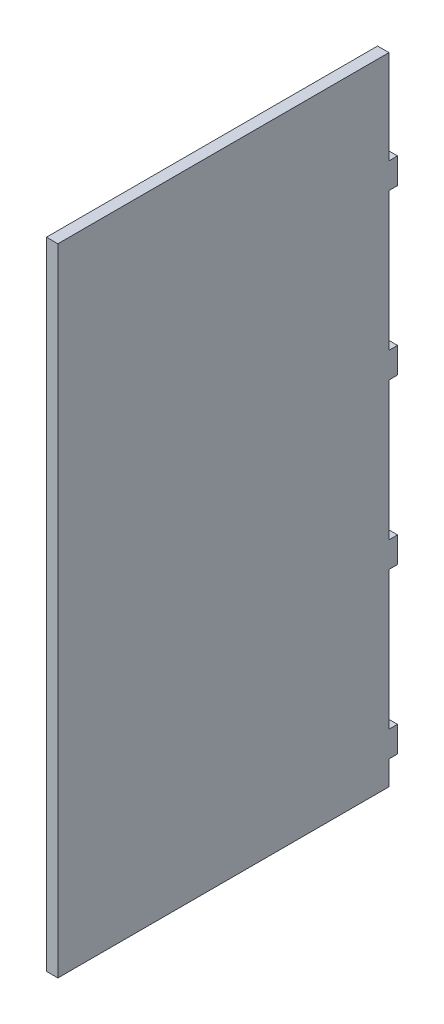
ISO-10303-21;
HEADER;
FILE_DESCRIPTION(('STEP AP214'),'2;1');
FILE_NAME('part.step','',(''),(''),'','','');
FILE_SCHEMA(('AUTOMOTIVE_DESIGN { 1 0 10303 214 1 1 1 1 }'));
ENDSEC;
DATA;
#1=APPLICATION_CONTEXT('core data for automotive mechanical design processes');
#2=APPLICATION_PROTOCOL_DEFINITION('international standard','automotive_design',2000,#1);
#3=PRODUCT_CONTEXT('',#1,'mechanical');
#4=PRODUCT('Part','Part','',(#3));
#5=PRODUCT_RELATED_PRODUCT_CATEGORY('part','',(#4));
#6=PRODUCT_DEFINITION_FORMATION('','',#4);
#7=PRODUCT_DEFINITION_CONTEXT('part definition',#1,'design');
#8=PRODUCT_DEFINITION('design','',#6,#7);
#9=PRODUCT_DEFINITION_SHAPE('','',#8);
#10=(LENGTH_UNIT() NAMED_UNIT(*) SI_UNIT(.MILLI.,.METRE.));
#11=(NAMED_UNIT(*) PLANE_ANGLE_UNIT() SI_UNIT($,.RADIAN.));
#12=(NAMED_UNIT(*) SI_UNIT($,.STERADIAN.) SOLID_ANGLE_UNIT());
#13=UNCERTAINTY_MEASURE_WITH_UNIT(LENGTH_MEASURE(1.E-05),#10,'distance_accuracy_value','');
#14=(GEOMETRIC_REPRESENTATION_CONTEXT(3) GLOBAL_UNCERTAINTY_ASSIGNED_CONTEXT((#13)) GLOBAL_UNIT_ASSIGNED_CONTEXT((#10,
#11,#12)) REPRESENTATION_CONTEXT('',''));
#15=CARTESIAN_POINT('',(0.,0.,0.));
#16=DIRECTION('',(0.,0.,1.));
#17=DIRECTION('',(1.,0.,0.));
#18=AXIS2_PLACEMENT_3D('',#15,#16,#17);
#19=CARTESIAN_POINT('',(215.,50.497083943488,0.));
#20=DIRECTION('',(0.,0.,1.));
#21=DIRECTION('',(0.,1.,0.));
#22=AXIS2_PLACEMENT_3D('',#19,#20,#21);
#23=PLANE('',#22);
#24=DIRECTION('',(1.,0.,0.));
#25=VECTOR('',#24,1.);
#26=CARTESIAN_POINT('',(215.,50.497083943488,0.));
#27=LINE('',#26,#25);
#28=CARTESIAN_POINT('',(211.,50.497083943488,0.));
#29=VERTEX_POINT('',#28);
#30=CARTESIAN_POINT('',(215.,50.497083943488,0.));
#31=VERTEX_POINT('',#30);
#32=EDGE_CURVE('E11',#29,#31,#27,.T.);
#33=ORIENTED_EDGE('',*,*,#32,.F.);
#34=DIRECTION('',(0.,1.,0.));
#35=VECTOR('',#34,1.);
#36=CARTESIAN_POINT('',(211.,0.,0.));
#37=LINE('',#36,#35);
#38=CARTESIAN_POINT('',(211.,83.3431457505073,0.));
#39=VERTEX_POINT('',#38);
#40=EDGE_CURVE('E140',#29,#39,#37,.T.);
#41=ORIENTED_EDGE('',*,*,#40,.T.);
#42=DIRECTION('',(1.,0.,0.));
#43=VECTOR('',#42,1.);
#44=CARTESIAN_POINT('',(215.,83.3431457505073,0.));
#45=LINE('',#44,#43);
#46=CARTESIAN_POINT('',(215.,83.3431457505073,0.));
#47=VERTEX_POINT('',#46);
#48=EDGE_CURVE('E47',#39,#47,#45,.T.);
#49=ORIENTED_EDGE('',*,*,#48,.T.);
#50=DIRECTION('',(0.,1.,0.));
#51=VECTOR('',#50,1.);
#52=CARTESIAN_POINT('',(215.,50.497083943488,0.));
#53=LINE('',#52,#51);
#54=EDGE_CURVE('E251',#31,#47,#53,.T.);
#55=ORIENTED_EDGE('',*,*,#54,.F.);
#56=EDGE_LOOP('',(#33,#41,#49,#55));
#57=FACE_BOUND('',#56,.T.);
#58=ADVANCED_FACE('F37',(#57),#23,.F.);
#59=CARTESIAN_POINT('',(215.,83.3431457505073,0.));
#60=DIRECTION('',(0.,-1.,0.));
#61=DIRECTION('',(0.,0.,1.));
#62=AXIS2_PLACEMENT_3D('',#59,#60,#61);
#63=PLANE('',#62);
#64=ORIENTED_EDGE('',*,*,#48,.F.);
#65=DIRECTION('',(0.,0.,1.));
#66=VECTOR('',#65,1.);
#67=CARTESIAN_POINT('',(211.,83.3431457505073,0.));
#68=LINE('',#67,#66);
#69=CARTESIAN_POINT('',(211.,83.3431457505073,116.));
#70=VERTEX_POINT('',#69);
#71=EDGE_CURVE('E195',#39,#70,#68,.T.);
#72=ORIENTED_EDGE('',*,*,#71,.T.);
#73=DIRECTION('',(1.,0.,0.));
#74=VECTOR('',#73,1.);
#75=CARTESIAN_POINT('',(215.,83.3431457505073,116.));
#76=LINE('',#75,#74);
#77=CARTESIAN_POINT('',(215.,83.3431457505073,116.));
#78=VERTEX_POINT('',#77);
#79=EDGE_CURVE('E244',#70,#78,#76,.T.);
#80=ORIENTED_EDGE('',*,*,#79,.T.);
#81=DIRECTION('',(0.,0.,1.));
#82=VECTOR('',#81,1.);
#83=CARTESIAN_POINT('',(215.,83.3431457505073,0.));
#84=LINE('',#83,#82);
#85=EDGE_CURVE('E260',#47,#78,#84,.T.);
#86=ORIENTED_EDGE('',*,*,#85,.F.);
#87=EDGE_LOOP('',(#64,#72,#80,#86));
#88=FACE_BOUND('',#87,.T.);
#89=ADVANCED_FACE('F263',(#88),#63,.F.);
#90=CARTESIAN_POINT('',(215.,83.3431457505073,116.));
#91=DIRECTION('',(0.,0.,-1.));
#92=DIRECTION('',(0.,-1.,0.));
#93=AXIS2_PLACEMENT_3D('',#90,#91,#92);
#94=PLANE('',#93);
#95=ORIENTED_EDGE('',*,*,#79,.F.);
#96=DIRECTION('',(0.,1.,0.));
#97=VECTOR('',#96,1.);
#98=CARTESIAN_POINT('',(211.,0.,116.));
#99=LINE('',#98,#97);
#100=CARTESIAN_POINT('',(211.,-139.403562499507,116.));
#101=VERTEX_POINT('',#100);
#102=EDGE_CURVE('E192',#70,#101,#99,.F.);
#103=ORIENTED_EDGE('',*,*,#102,.T.);
#104=DIRECTION('',(1.,0.,0.));
#105=VECTOR('',#104,1.);
#106=CARTESIAN_POINT('',(215.,-139.403562499507,116.));
#107=LINE('',#106,#105);
#108=CARTESIAN_POINT('',(215.,-139.403562499507,116.));
#109=VERTEX_POINT('',#108);
#110=EDGE_CURVE('E241',#101,#109,#107,.T.);
#111=ORIENTED_EDGE('',*,*,#110,.T.);
#112=DIRECTION('',(0.,-1.,0.));
#113=VECTOR('',#112,1.);
#114=CARTESIAN_POINT('',(215.,83.3431457505073,116.));
#115=LINE('',#114,#113);
#116=EDGE_CURVE('E264',#78,#109,#115,.T.);
#117=ORIENTED_EDGE('',*,*,#116,.F.);
#118=EDGE_LOOP('',(#95,#103,#111,#117));
#119=FACE_BOUND('',#118,.T.);
#120=ADVANCED_FACE('F359',(#119),#94,.F.);
#121=CARTESIAN_POINT('',(215.,-139.403562499507,116.));
#122=DIRECTION('',(0.,1.,0.));
#123=DIRECTION('',(0.,0.,-1.));
#124=AXIS2_PLACEMENT_3D('',#121,#122,#123);
#125=PLANE('',#124);
#126=ORIENTED_EDGE('',*,*,#110,.F.);
#127=DIRECTION('',(0.,0.,1.));
#128=VECTOR('',#127,1.);
#129=CARTESIAN_POINT('',(211.,-139.403562499507,0.));
#130=LINE('',#129,#128);
#131=CARTESIAN_POINT('',(211.,-139.403562499507,0.));
#132=VERTEX_POINT('',#131);
#133=EDGE_CURVE('E189',#101,#132,#130,.F.);
#134=ORIENTED_EDGE('',*,*,#133,.T.);
#135=DIRECTION('',(1.,0.,0.));
#136=VECTOR('',#135,1.);
#137=CARTESIAN_POINT('',(215.,-139.403562499507,0.));
#138=LINE('',#137,#136);
#139=CARTESIAN_POINT('',(215.,-139.403562499507,0.));
#140=VERTEX_POINT('',#139);
#141=EDGE_CURVE('E238',#132,#140,#138,.T.);
#142=ORIENTED_EDGE('',*,*,#141,.T.);
#143=DIRECTION('',(0.,0.,-1.));
#144=VECTOR('',#143,1.);
#145=CARTESIAN_POINT('',(215.,-139.403562499507,116.));
#146=LINE('',#145,#144);
#147=EDGE_CURVE('E266',#109,#140,#146,.T.);
#148=ORIENTED_EDGE('',*,*,#147,.F.);
#149=EDGE_LOOP('',(#126,#134,#142,#148));
#150=FACE_BOUND('',#149,.T.);
#151=ADVANCED_FACE('F365',(#150),#125,.F.);
#152=CARTESIAN_POINT('',(215.,-130.942190151143,0.));
#153=DIRECTION('',(0.,0.,1.));
#154=DIRECTION('',(0.,1.,0.));
#155=AXIS2_PLACEMENT_3D('',#152,#153,#154);
#156=PLANE('',#155);
#157=ORIENTED_EDGE('',*,*,#141,.F.);
#158=DIRECTION('',(0.,1.,0.));
#159=VECTOR('',#158,1.);
#160=CARTESIAN_POINT('',(211.,0.,0.));
#161=LINE('',#160,#159);
#162=CARTESIAN_POINT('',(211.,-130.942190151143,0.));
#163=VERTEX_POINT('',#162);
#164=EDGE_CURVE('E186',#132,#163,#161,.T.);
#165=ORIENTED_EDGE('',*,*,#164,.T.);
#166=DIRECTION('',(1.,0.,0.));
#167=VECTOR('',#166,1.);
#168=CARTESIAN_POINT('',(215.,-130.942190151143,0.));
#169=LINE('',#168,#167);
#170=CARTESIAN_POINT('',(215.,-130.942190151143,0.));
#171=VERTEX_POINT('',#170);
#172=EDGE_CURVE('E235',#163,#171,#169,.T.);
#173=ORIENTED_EDGE('',*,*,#172,.T.);
#174=DIRECTION('',(0.,1.,0.));
#175=VECTOR('',#174,1.);
#176=CARTESIAN_POINT('',(215.,-130.942190151143,0.));
#177=LINE('',#176,#175);
#178=EDGE_CURVE('E272',#140,#171,#177,.T.);
#179=ORIENTED_EDGE('',*,*,#178,.F.);
#180=EDGE_LOOP('',(#157,#165,#173,#179));
#181=FACE_BOUND('',#180,.T.);
#182=ADVANCED_FACE('F368',(#181),#156,.F.);
#183=CARTESIAN_POINT('',(215.,-130.942190151143,-3.00000000000002));
#184=DIRECTION('',(0.,1.,0.));
#185=DIRECTION('',(0.,0.,-1.));
#186=AXIS2_PLACEMENT_3D('',#183,#184,#185);
#187=PLANE('',#186);
#188=ORIENTED_EDGE('',*,*,#172,.F.);
#189=DIRECTION('',(0.,0.,1.));
#190=VECTOR('',#189,1.);
#191=CARTESIAN_POINT('',(211.,-130.942190151143,0.));
#192=LINE('',#191,#190);
#193=CARTESIAN_POINT('',(211.,-130.942190151143,-3.00000000000002));
#194=VERTEX_POINT('',#193);
#195=EDGE_CURVE('E183',#163,#194,#192,.F.);
#196=ORIENTED_EDGE('',*,*,#195,.T.);
#197=DIRECTION('',(1.,0.,0.));
#198=VECTOR('',#197,1.);
#199=CARTESIAN_POINT('',(215.,-130.942190151143,-3.00000000000002));
#200=LINE('',#199,#198);
#201=CARTESIAN_POINT('',(215.,-130.942190151143,-3.00000000000002));
#202=VERTEX_POINT('',#201);
#203=EDGE_CURVE('E232',#194,#202,#200,.T.);
#204=ORIENTED_EDGE('',*,*,#203,.T.);
#205=DIRECTION('',(0.,0.,-1.));
#206=VECTOR('',#205,1.);
#207=CARTESIAN_POINT('',(215.,-130.942190151143,-3.00000000000002));
#208=LINE('',#207,#206);
#209=EDGE_CURVE('E275',#171,#202,#208,.T.);
#210=ORIENTED_EDGE('',*,*,#209,.F.);
#211=EDGE_LOOP('',(#188,#196,#204,#210));
#212=FACE_BOUND('',#211,.T.);
#213=ADVANCED_FACE('F373',(#212),#187,.F.);
#214=CARTESIAN_POINT('',(215.,-121.942190151142,-3.00000000000002));
#215=DIRECTION('',(0.,0.,1.));
#216=DIRECTION('',(0.,1.,0.));
#217=AXIS2_PLACEMENT_3D('',#214,#215,#216);
#218=PLANE('',#217);
#219=ORIENTED_EDGE('',*,*,#203,.F.);
#220=DIRECTION('',(0.,1.,0.));
#221=VECTOR('',#220,1.);
#222=CARTESIAN_POINT('',(211.,0.,-3.00000000000002));
#223=LINE('',#222,#221);
#224=CARTESIAN_POINT('',(211.,-121.942190151142,-3.00000000000002));
#225=VERTEX_POINT('',#224);
#226=EDGE_CURVE('E180',#194,#225,#223,.T.);
#227=ORIENTED_EDGE('',*,*,#226,.T.);
#228=DIRECTION('',(1.,0.,0.));
#229=VECTOR('',#228,1.);
#230=CARTESIAN_POINT('',(215.,-121.942190151142,-3.00000000000002));
#231=LINE('',#230,#229);
#232=CARTESIAN_POINT('',(215.,-121.942190151142,-3.00000000000002));
#233=VERTEX_POINT('',#232);
#234=EDGE_CURVE('E229',#225,#233,#231,.T.);
#235=ORIENTED_EDGE('',*,*,#234,.T.);
#236=DIRECTION('',(0.,1.,0.));
#237=VECTOR('',#236,1.);
#238=CARTESIAN_POINT('',(215.,-121.942190151142,-3.00000000000002));
#239=LINE('',#238,#237);
#240=EDGE_CURVE('E278',#202,#233,#239,.T.);
#241=ORIENTED_EDGE('',*,*,#240,.F.);
#242=EDGE_LOOP('',(#219,#227,#235,#241));
#243=FACE_BOUND('',#242,.T.);
#244=ADVANCED_FACE('F378',(#243),#218,.F.);
#245=CARTESIAN_POINT('',(215.,-121.942190151142,0.));
#246=DIRECTION('',(0.,-1.,0.));
#247=DIRECTION('',(0.,0.,1.));
#248=AXIS2_PLACEMENT_3D('',#245,#246,#247);
#249=PLANE('',#248);
#250=ORIENTED_EDGE('',*,*,#234,.F.);
#251=DIRECTION('',(0.,0.,1.));
#252=VECTOR('',#251,1.);
#253=CARTESIAN_POINT('',(211.,-121.942190151142,0.));
#254=LINE('',#253,#252);
#255=CARTESIAN_POINT('',(211.,-121.942190151142,0.));
#256=VERTEX_POINT('',#255);
#257=EDGE_CURVE('E177',#225,#256,#254,.T.);
#258=ORIENTED_EDGE('',*,*,#257,.T.);
#259=DIRECTION('',(1.,0.,0.));
#260=VECTOR('',#259,1.);
#261=CARTESIAN_POINT('',(215.,-121.942190151142,0.));
#262=LINE('',#261,#260);
#263=CARTESIAN_POINT('',(215.,-121.942190151142,0.));
#264=VERTEX_POINT('',#263);
#265=EDGE_CURVE('E226',#256,#264,#262,.T.);
#266=ORIENTED_EDGE('',*,*,#265,.T.);
#267=DIRECTION('',(0.,0.,1.));
#268=VECTOR('',#267,1.);
#269=CARTESIAN_POINT('',(215.,-121.942190151142,0.));
#270=LINE('',#269,#268);
#271=EDGE_CURVE('E281',#233,#264,#270,.T.);
#272=ORIENTED_EDGE('',*,*,#271,.F.);
#273=EDGE_LOOP('',(#250,#258,#266,#272));
#274=FACE_BOUND('',#273,.T.);
#275=ADVANCED_FACE('F380',(#274),#249,.F.);
#276=CARTESIAN_POINT('',(215.,-73.462432119599,0.));
#277=DIRECTION('',(0.,0.,1.));
#278=DIRECTION('',(0.,1.,0.));
#279=AXIS2_PLACEMENT_3D('',#276,#277,#278);
#280=PLANE('',#279);
#281=ORIENTED_EDGE('',*,*,#265,.F.);
#282=DIRECTION('',(0.,1.,0.));
#283=VECTOR('',#282,1.);
#284=CARTESIAN_POINT('',(211.,0.,0.));
#285=LINE('',#284,#283);
#286=CARTESIAN_POINT('',(211.,-73.462432119599,0.));
#287=VERTEX_POINT('',#286);
#288=EDGE_CURVE('E174',#256,#287,#285,.T.);
#289=ORIENTED_EDGE('',*,*,#288,.T.);
#290=DIRECTION('',(1.,0.,0.));
#291=VECTOR('',#290,1.);
#292=CARTESIAN_POINT('',(215.,-73.462432119599,0.));
#293=LINE('',#292,#291);
#294=CARTESIAN_POINT('',(215.,-73.462432119599,0.));
#295=VERTEX_POINT('',#294);
#296=EDGE_CURVE('E223',#287,#295,#293,.T.);
#297=ORIENTED_EDGE('',*,*,#296,.T.);
#298=DIRECTION('',(0.,1.,0.));
#299=VECTOR('',#298,1.);
#300=CARTESIAN_POINT('',(215.,-73.462432119599,0.));
#301=LINE('',#300,#299);
#302=EDGE_CURVE('E284',#264,#295,#301,.T.);
#303=ORIENTED_EDGE('',*,*,#302,.F.);
#304=EDGE_LOOP('',(#281,#289,#297,#303));
#305=FACE_BOUND('',#304,.T.);
#306=ADVANCED_FACE('F385',(#305),#280,.F.);
#307=CARTESIAN_POINT('',(215.,-73.462432119599,-3.00000000000002));
#308=DIRECTION('',(0.,1.,0.));
#309=DIRECTION('',(0.,0.,-1.));
#310=AXIS2_PLACEMENT_3D('',#307,#308,#309);
#311=PLANE('',#310);
#312=ORIENTED_EDGE('',*,*,#296,.F.);
#313=DIRECTION('',(0.,0.,1.));
#314=VECTOR('',#313,1.);
#315=CARTESIAN_POINT('',(211.,-73.462432119599,0.));
#316=LINE('',#315,#314);
#317=CARTESIAN_POINT('',(211.,-73.462432119599,-3.00000000000002));
#318=VERTEX_POINT('',#317);
#319=EDGE_CURVE('E171',#287,#318,#316,.F.);
#320=ORIENTED_EDGE('',*,*,#319,.T.);
#321=DIRECTION('',(1.,0.,0.));
#322=VECTOR('',#321,1.);
#323=CARTESIAN_POINT('',(215.,-73.462432119599,-3.00000000000002));
#324=LINE('',#323,#322);
#325=CARTESIAN_POINT('',(215.,-73.462432119599,-3.00000000000002));
#326=VERTEX_POINT('',#325);
#327=EDGE_CURVE('E220',#318,#326,#324,.T.);
#328=ORIENTED_EDGE('',*,*,#327,.T.);
#329=DIRECTION('',(0.,0.,-1.));
#330=VECTOR('',#329,1.);
#331=CARTESIAN_POINT('',(215.,-73.462432119599,-3.00000000000002));
#332=LINE('',#331,#330);
#333=EDGE_CURVE('E287',#295,#326,#332,.T.);
#334=ORIENTED_EDGE('',*,*,#333,.F.);
#335=EDGE_LOOP('',(#312,#320,#328,#334));
#336=FACE_BOUND('',#335,.T.);
#337=ADVANCED_FACE('F390',(#336),#311,.F.);
#338=CARTESIAN_POINT('',(215.,-64.462432119599,-3.00000000000001));
#339=DIRECTION('',(0.,0.,1.));
#340=DIRECTION('',(0.,1.,0.));
#341=AXIS2_PLACEMENT_3D('',#338,#339,#340);
#342=PLANE('',#341);
#343=ORIENTED_EDGE('',*,*,#327,.F.);
#344=DIRECTION('',(0.,1.,0.));
#345=VECTOR('',#344,1.);
#346=CARTESIAN_POINT('',(211.,0.,-3.00000000000002));
#347=LINE('',#346,#345);
#348=CARTESIAN_POINT('',(211.,-64.462432119599,-3.00000000000001));
#349=VERTEX_POINT('',#348);
#350=EDGE_CURVE('E168',#318,#349,#347,.T.);
#351=ORIENTED_EDGE('',*,*,#350,.T.);
#352=DIRECTION('',(1.,0.,0.));
#353=VECTOR('',#352,1.);
#354=CARTESIAN_POINT('',(215.,-64.462432119599,-3.00000000000001));
#355=LINE('',#354,#353);
#356=CARTESIAN_POINT('',(215.,-64.462432119599,-3.00000000000001));
#357=VERTEX_POINT('',#356);
#358=EDGE_CURVE('E217',#349,#357,#355,.T.);
#359=ORIENTED_EDGE('',*,*,#358,.T.);
#360=DIRECTION('',(0.,1.,0.));
#361=VECTOR('',#360,1.);
#362=CARTESIAN_POINT('',(215.,-64.462432119599,-3.00000000000001));
#363=LINE('',#362,#361);
#364=EDGE_CURVE('E290',#326,#357,#363,.T.);
#365=ORIENTED_EDGE('',*,*,#364,.F.);
#366=EDGE_LOOP('',(#343,#351,#359,#365));
#367=FACE_BOUND('',#366,.T.);
#368=ADVANCED_FACE('F392',(#367),#342,.F.);
#369=CARTESIAN_POINT('',(215.,-64.462432119599,0.));
#370=DIRECTION('',(0.,-1.,0.));
#371=DIRECTION('',(0.,0.,1.));
#372=AXIS2_PLACEMENT_3D('',#369,#370,#371);
#373=PLANE('',#372);
#374=ORIENTED_EDGE('',*,*,#358,.F.);
#375=DIRECTION('',(0.,0.,1.));
#376=VECTOR('',#375,1.);
#377=CARTESIAN_POINT('',(211.,-64.462432119599,0.));
#378=LINE('',#377,#376);
#379=CARTESIAN_POINT('',(211.,-64.462432119599,0.));
#380=VERTEX_POINT('',#379);
#381=EDGE_CURVE('E165',#349,#380,#378,.T.);
#382=ORIENTED_EDGE('',*,*,#381,.T.);
#383=DIRECTION('',(1.,0.,0.));
#384=VECTOR('',#383,1.);
#385=CARTESIAN_POINT('',(215.,-64.462432119599,0.));
#386=LINE('',#385,#384);
#387=CARTESIAN_POINT('',(215.,-64.462432119599,0.));
#388=VERTEX_POINT('',#387);
#389=EDGE_CURVE('E214',#380,#388,#386,.T.);
#390=ORIENTED_EDGE('',*,*,#389,.T.);
#391=DIRECTION('',(0.,0.,1.));
#392=VECTOR('',#391,1.);
#393=CARTESIAN_POINT('',(215.,-64.462432119599,0.));
#394=LINE('',#393,#392);
#395=EDGE_CURVE('E293',#357,#388,#394,.T.);
#396=ORIENTED_EDGE('',*,*,#395,.F.);
#397=EDGE_LOOP('',(#374,#382,#390,#396));
#398=FACE_BOUND('',#397,.T.);
#399=ADVANCED_FACE('F396',(#398),#373,.F.);
#400=CARTESIAN_POINT('',(215.,-15.9826740880555,0.));
#401=DIRECTION('',(0.,0.,1.));
#402=DIRECTION('',(0.,1.,0.));
#403=AXIS2_PLACEMENT_3D('',#400,#401,#402);
#404=PLANE('',#403);
#405=ORIENTED_EDGE('',*,*,#389,.F.);
#406=DIRECTION('',(0.,1.,0.));
#407=VECTOR('',#406,1.);
#408=CARTESIAN_POINT('',(211.,0.,0.));
#409=LINE('',#408,#407);
#410=CARTESIAN_POINT('',(211.,-15.9826740880555,0.));
#411=VERTEX_POINT('',#410);
#412=EDGE_CURVE('E162',#380,#411,#409,.T.);
#413=ORIENTED_EDGE('',*,*,#412,.T.);
#414=DIRECTION('',(1.,0.,0.));
#415=VECTOR('',#414,1.);
#416=CARTESIAN_POINT('',(215.,-15.9826740880555,0.));
#417=LINE('',#416,#415);
#418=CARTESIAN_POINT('',(215.,-15.9826740880555,0.));
#419=VERTEX_POINT('',#418);
#420=EDGE_CURVE('E211',#411,#419,#417,.T.);
#421=ORIENTED_EDGE('',*,*,#420,.T.);
#422=DIRECTION('',(0.,1.,0.));
#423=VECTOR('',#422,1.);
#424=CARTESIAN_POINT('',(215.,-15.9826740880555,0.));
#425=LINE('',#424,#423);
#426=EDGE_CURVE('E296',#388,#419,#425,.T.);
#427=ORIENTED_EDGE('',*,*,#426,.F.);
#428=EDGE_LOOP('',(#405,#413,#421,#427));
#429=FACE_BOUND('',#428,.T.);
#430=ADVANCED_FACE('F398',(#429),#404,.F.);
#431=CARTESIAN_POINT('',(215.,-15.9826740880555,-3.00000000000001));
#432=DIRECTION('',(0.,1.,0.));
#433=DIRECTION('',(0.,0.,-1.));
#434=AXIS2_PLACEMENT_3D('',#431,#432,#433);
#435=PLANE('',#434);
#436=ORIENTED_EDGE('',*,*,#420,.F.);
#437=DIRECTION('',(0.,0.,1.));
#438=VECTOR('',#437,1.);
#439=CARTESIAN_POINT('',(211.,-15.9826740880555,0.));
#440=LINE('',#439,#438);
#441=CARTESIAN_POINT('',(211.,-15.9826740880555,-3.00000000000001));
#442=VERTEX_POINT('',#441);
#443=EDGE_CURVE('E159',#411,#442,#440,.F.);
#444=ORIENTED_EDGE('',*,*,#443,.T.);
#445=DIRECTION('',(1.,0.,0.));
#446=VECTOR('',#445,1.);
#447=CARTESIAN_POINT('',(215.,-15.9826740880555,-3.00000000000001));
#448=LINE('',#447,#446);
#449=CARTESIAN_POINT('',(215.,-15.9826740880555,-3.00000000000001));
#450=VERTEX_POINT('',#449);
#451=EDGE_CURVE('E208',#442,#450,#448,.T.);
#452=ORIENTED_EDGE('',*,*,#451,.T.);
#453=DIRECTION('',(0.,0.,-1.));
#454=VECTOR('',#453,1.);
#455=CARTESIAN_POINT('',(215.,-15.9826740880555,-3.00000000000001));
#456=LINE('',#455,#454);
#457=EDGE_CURVE('E299',#419,#450,#456,.T.);
#458=ORIENTED_EDGE('',*,*,#457,.F.);
#459=EDGE_LOOP('',(#436,#444,#452,#458));
#460=FACE_BOUND('',#459,.T.);
#461=ADVANCED_FACE('F331',(#460),#435,.F.);
#462=CARTESIAN_POINT('',(215.,-6.98267408805553,-3.00000000000001));
#463=DIRECTION('',(0.,0.,1.));
#464=DIRECTION('',(0.,1.,0.));
#465=AXIS2_PLACEMENT_3D('',#462,#463,#464);
#466=PLANE('',#465);
#467=ORIENTED_EDGE('',*,*,#451,.F.);
#468=DIRECTION('',(0.,1.,0.));
#469=VECTOR('',#468,1.);
#470=CARTESIAN_POINT('',(211.,0.,-3.00000000000001));
#471=LINE('',#470,#469);
#472=CARTESIAN_POINT('',(211.,-6.98267408805553,-3.00000000000001));
#473=VERTEX_POINT('',#472);
#474=EDGE_CURVE('E156',#442,#473,#471,.T.);
#475=ORIENTED_EDGE('',*,*,#474,.T.);
#476=DIRECTION('',(1.,0.,0.));
#477=VECTOR('',#476,1.);
#478=CARTESIAN_POINT('',(215.,-6.98267408805553,-3.00000000000001));
#479=LINE('',#478,#477);
#480=CARTESIAN_POINT('',(215.,-6.98267408805553,-3.00000000000001));
#481=VERTEX_POINT('',#480);
#482=EDGE_CURVE('E205',#473,#481,#479,.T.);
#483=ORIENTED_EDGE('',*,*,#482,.T.);
#484=DIRECTION('',(0.,1.,0.));
#485=VECTOR('',#484,1.);
#486=CARTESIAN_POINT('',(215.,-6.98267408805553,-3.00000000000001));
#487=LINE('',#486,#485);
#488=EDGE_CURVE('E302',#450,#481,#487,.T.);
#489=ORIENTED_EDGE('',*,*,#488,.F.);
#490=EDGE_LOOP('',(#467,#475,#483,#489));
#491=FACE_BOUND('',#490,.T.);
#492=ADVANCED_FACE('F323',(#491),#466,.F.);
#493=CARTESIAN_POINT('',(215.,-6.98267408805553,0.));
#494=DIRECTION('',(0.,-1.,0.));
#495=DIRECTION('',(0.,0.,1.));
#496=AXIS2_PLACEMENT_3D('',#493,#494,#495);
#497=PLANE('',#496);
#498=ORIENTED_EDGE('',*,*,#482,.F.);
#499=DIRECTION('',(0.,0.,1.));
#500=VECTOR('',#499,1.);
#501=CARTESIAN_POINT('',(211.,-6.98267408805553,0.));
#502=LINE('',#501,#500);
#503=CARTESIAN_POINT('',(211.,-6.98267408805553,0.));
#504=VERTEX_POINT('',#503);
#505=EDGE_CURVE('E153',#473,#504,#502,.T.);
#506=ORIENTED_EDGE('',*,*,#505,.T.);
#507=DIRECTION('',(1.,0.,0.));
#508=VECTOR('',#507,1.);
#509=CARTESIAN_POINT('',(215.,-6.98267408805553,0.));
#510=LINE('',#509,#508);
#511=CARTESIAN_POINT('',(215.,-6.98267408805553,0.));
#512=VERTEX_POINT('',#511);
#513=EDGE_CURVE('E202',#504,#512,#510,.T.);
#514=ORIENTED_EDGE('',*,*,#513,.T.);
#515=DIRECTION('',(0.,0.,1.));
#516=VECTOR('',#515,1.);
#517=CARTESIAN_POINT('',(215.,-6.98267408805553,0.));
#518=LINE('',#517,#516);
#519=EDGE_CURVE('E305',#481,#512,#518,.T.);
#520=ORIENTED_EDGE('',*,*,#519,.F.);
#521=EDGE_LOOP('',(#498,#506,#514,#520));
#522=FACE_BOUND('',#521,.T.);
#523=ADVANCED_FACE('F318',(#522),#497,.F.);
#524=CARTESIAN_POINT('',(215.,41.497083943488,0.));
#525=DIRECTION('',(0.,0.,1.));
#526=DIRECTION('',(0.,1.,0.));
#527=AXIS2_PLACEMENT_3D('',#524,#525,#526);
#528=PLANE('',#527);
#529=ORIENTED_EDGE('',*,*,#513,.F.);
#530=DIRECTION('',(0.,1.,0.));
#531=VECTOR('',#530,1.);
#532=CARTESIAN_POINT('',(211.,0.,0.));
#533=LINE('',#532,#531);
#534=CARTESIAN_POINT('',(211.,41.497083943488,0.));
#535=VERTEX_POINT('',#534);
#536=EDGE_CURVE('E150',#504,#535,#533,.T.);
#537=ORIENTED_EDGE('',*,*,#536,.T.);
#538=DIRECTION('',(1.,0.,0.));
#539=VECTOR('',#538,1.);
#540=CARTESIAN_POINT('',(215.,41.497083943488,0.));
#541=LINE('',#540,#539);
#542=CARTESIAN_POINT('',(215.,41.497083943488,0.));
#543=VERTEX_POINT('',#542);
#544=EDGE_CURVE('E200',#535,#543,#541,.T.);
#545=ORIENTED_EDGE('',*,*,#544,.T.);
#546=DIRECTION('',(0.,1.,0.));
#547=VECTOR('',#546,1.);
#548=CARTESIAN_POINT('',(215.,41.497083943488,0.));
#549=LINE('',#548,#547);
#550=EDGE_CURVE('E307',#512,#543,#549,.T.);
#551=ORIENTED_EDGE('',*,*,#550,.F.);
#552=EDGE_LOOP('',(#529,#537,#545,#551));
#553=FACE_BOUND('',#552,.T.);
#554=ADVANCED_FACE('F314',(#553),#528,.F.);
#555=CARTESIAN_POINT('',(215.,41.497083943488,-3.));
#556=DIRECTION('',(0.,1.,0.));
#557=DIRECTION('',(0.,0.,-1.));
#558=AXIS2_PLACEMENT_3D('',#555,#556,#557);
#559=PLANE('',#558);
#560=ORIENTED_EDGE('',*,*,#544,.F.);
#561=DIRECTION('',(0.,0.,1.));
#562=VECTOR('',#561,1.);
#563=CARTESIAN_POINT('',(211.,41.497083943488,0.));
#564=LINE('',#563,#562);
#565=CARTESIAN_POINT('',(211.,41.497083943488,-3.));
#566=VERTEX_POINT('',#565);
#567=EDGE_CURVE('E147',#535,#566,#564,.F.);
#568=ORIENTED_EDGE('',*,*,#567,.T.);
#569=DIRECTION('',(1.,0.,0.));
#570=VECTOR('',#569,1.);
#571=CARTESIAN_POINT('',(215.,41.497083943488,-3.));
#572=LINE('',#571,#570);
#573=CARTESIAN_POINT('',(215.,41.497083943488,-3.));
#574=VERTEX_POINT('',#573);
#575=EDGE_CURVE('E55',#566,#574,#572,.T.);
#576=ORIENTED_EDGE('',*,*,#575,.T.);
#577=DIRECTION('',(0.,0.,-1.));
#578=VECTOR('',#577,1.);
#579=CARTESIAN_POINT('',(215.,41.497083943488,-3.));
#580=LINE('',#579,#578);
#581=EDGE_CURVE('E133',#543,#574,#580,.T.);
#582=ORIENTED_EDGE('',*,*,#581,.F.);
#583=EDGE_LOOP('',(#560,#568,#576,#582));
#584=FACE_BOUND('',#583,.T.);
#585=ADVANCED_FACE('F311',(#584),#559,.F.);
#586=CARTESIAN_POINT('',(215.,50.497083943488,-3.));
#587=DIRECTION('',(0.,0.,1.));
#588=DIRECTION('',(0.,1.,0.));
#589=AXIS2_PLACEMENT_3D('',#586,#587,#588);
#590=PLANE('',#589);
#591=ORIENTED_EDGE('',*,*,#575,.F.);
#592=DIRECTION('',(0.,1.,0.));
#593=VECTOR('',#592,1.);
#594=CARTESIAN_POINT('',(211.,0.,-3.));
#595=LINE('',#594,#593);
#596=CARTESIAN_POINT('',(211.,50.497083943488,-3.));
#597=VERTEX_POINT('',#596);
#598=EDGE_CURVE('E138',#566,#597,#595,.T.);
#599=ORIENTED_EDGE('',*,*,#598,.T.);
#600=DIRECTION('',(1.,0.,0.));
#601=VECTOR('',#600,1.);
#602=CARTESIAN_POINT('',(215.,50.497083943488,-3.));
#603=LINE('',#602,#601);
#604=CARTESIAN_POINT('',(215.,50.497083943488,-3.));
#605=VERTEX_POINT('',#604);
#606=EDGE_CURVE('E41',#597,#605,#603,.T.);
#607=ORIENTED_EDGE('',*,*,#606,.T.);
#608=DIRECTION('',(0.,1.,0.));
#609=VECTOR('',#608,1.);
#610=CARTESIAN_POINT('',(215.,50.497083943488,-3.));
#611=LINE('',#610,#609);
#612=EDGE_CURVE('E149',#574,#605,#611,.T.);
#613=ORIENTED_EDGE('',*,*,#612,.F.);
#614=EDGE_LOOP('',(#591,#599,#607,#613));
#615=FACE_BOUND('',#614,.T.);
#616=ADVANCED_FACE('F142',(#615),#590,.F.);
#617=CARTESIAN_POINT('',(215.,50.497083943488,-3.));
#618=DIRECTION('',(0.,-1.,0.));
#619=DIRECTION('',(0.,0.,1.));
#620=AXIS2_PLACEMENT_3D('',#617,#618,#619);
#621=PLANE('',#620);
#622=DIRECTION('',(0.,0.,1.));
#623=VECTOR('',#622,1.);
#624=CARTESIAN_POINT('',(211.,50.497083943488,0.));
#625=LINE('',#624,#623);
#626=EDGE_CURVE('E127',#597,#29,#625,.T.);
#627=ORIENTED_EDGE('',*,*,#626,.T.);
#628=ORIENTED_EDGE('',*,*,#32,.T.);
#629=DIRECTION('',(0.,0.,1.));
#630=VECTOR('',#629,1.);
#631=CARTESIAN_POINT('',(215.,50.497083943488,-3.));
#632=LINE('',#631,#630);
#633=EDGE_CURVE('E129',#605,#31,#632,.T.);
#634=ORIENTED_EDGE('',*,*,#633,.F.);
#635=ORIENTED_EDGE('',*,*,#606,.F.);
#636=EDGE_LOOP('',(#627,#628,#634,#635));
#637=FACE_BOUND('',#636,.T.);
#638=ADVANCED_FACE('F39',(#637),#621,.F.);
#639=CARTESIAN_POINT('',(215.,0.,0.));
#640=DIRECTION('',(-1.,0.,0.));
#641=DIRECTION('',(0.,0.,1.));
#642=AXIS2_PLACEMENT_3D('',#639,#640,#641);
#643=PLANE('',#642);
#644=ORIENTED_EDGE('',*,*,#612,.T.);
#645=ORIENTED_EDGE('',*,*,#633,.T.);
#646=ORIENTED_EDGE('',*,*,#54,.T.);
#647=ORIENTED_EDGE('',*,*,#85,.T.);
#648=ORIENTED_EDGE('',*,*,#116,.T.);
#649=ORIENTED_EDGE('',*,*,#147,.T.);
#650=ORIENTED_EDGE('',*,*,#178,.T.);
#651=ORIENTED_EDGE('',*,*,#209,.T.);
#652=ORIENTED_EDGE('',*,*,#240,.T.);
#653=ORIENTED_EDGE('',*,*,#271,.T.);
#654=ORIENTED_EDGE('',*,*,#302,.T.);
#655=ORIENTED_EDGE('',*,*,#333,.T.);
#656=ORIENTED_EDGE('',*,*,#364,.T.);
#657=ORIENTED_EDGE('',*,*,#395,.T.);
#658=ORIENTED_EDGE('',*,*,#426,.T.);
#659=ORIENTED_EDGE('',*,*,#457,.T.);
#660=ORIENTED_EDGE('',*,*,#488,.T.);
#661=ORIENTED_EDGE('',*,*,#519,.T.);
#662=ORIENTED_EDGE('',*,*,#550,.T.);
#663=ORIENTED_EDGE('',*,*,#581,.T.);
#664=EDGE_LOOP('',(#644,#645,#646,#647,#648,#649,#650,#651,#652,#653,#654,#655,#656,#657,#658,
#659,#660,#661,#662,#663));
#665=FACE_BOUND('',#664,.T.);
#666=ADVANCED_FACE('F258',(#665),#643,.F.);
#667=CARTESIAN_POINT('',(211.,0.,0.));
#668=DIRECTION('',(-1.,0.,0.));
#669=DIRECTION('',(0.,0.,1.));
#670=AXIS2_PLACEMENT_3D('',#667,#668,#669);
#671=PLANE('',#670);
#672=ORIENTED_EDGE('',*,*,#598,.F.);
#673=ORIENTED_EDGE('',*,*,#567,.F.);
#674=ORIENTED_EDGE('',*,*,#536,.F.);
#675=ORIENTED_EDGE('',*,*,#505,.F.);
#676=ORIENTED_EDGE('',*,*,#474,.F.);
#677=ORIENTED_EDGE('',*,*,#443,.F.);
#678=ORIENTED_EDGE('',*,*,#412,.F.);
#679=ORIENTED_EDGE('',*,*,#381,.F.);
#680=ORIENTED_EDGE('',*,*,#350,.F.);
#681=ORIENTED_EDGE('',*,*,#319,.F.);
#682=ORIENTED_EDGE('',*,*,#288,.F.);
#683=ORIENTED_EDGE('',*,*,#257,.F.);
#684=ORIENTED_EDGE('',*,*,#226,.F.);
#685=ORIENTED_EDGE('',*,*,#195,.F.);
#686=ORIENTED_EDGE('',*,*,#164,.F.);
#687=ORIENTED_EDGE('',*,*,#133,.F.);
#688=ORIENTED_EDGE('',*,*,#102,.F.);
#689=ORIENTED_EDGE('',*,*,#71,.F.);
#690=ORIENTED_EDGE('',*,*,#40,.F.);
#691=ORIENTED_EDGE('',*,*,#626,.F.);
#692=EDGE_LOOP('',(#672,#673,#674,#675,#676,#677,#678,#679,#680,#681,#682,#683,#684,#685,#686,
#687,#688,#689,#690,#691));
#693=FACE_BOUND('',#692,.T.);
#694=ADVANCED_FACE('F136',(#693),#671,.T.);
#695=CLOSED_SHELL('',(#58,#89,#120,#151,#182,#213,#244,#275,#306,#337,#368,#399,#430,#461,#492,
#523,#554,#585,#616,#638,#666,#694));
#696=MANIFOLD_SOLID_BREP('B2',#695);
#697=ADVANCED_BREP_SHAPE_REPRESENTATION('',(#18,#696),#14);
#698=SHAPE_DEFINITION_REPRESENTATION(#9,#697);
ENDSEC;
END-ISO-10303-21;
